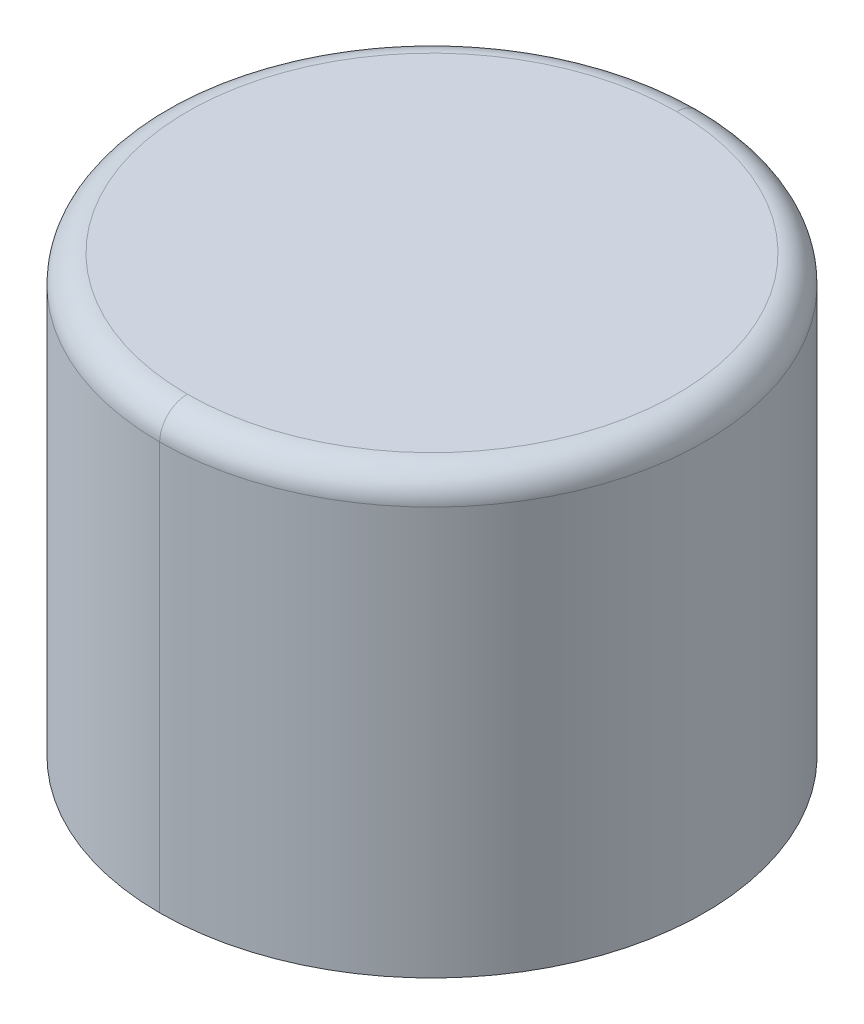
ISO-10303-21;
HEADER;
FILE_DESCRIPTION(('STEP AP214'),'2;1');
FILE_NAME('part.step','',(''),(''),'','','');
FILE_SCHEMA(('AUTOMOTIVE_DESIGN { 1 0 10303 214 1 1 1 1 }'));
ENDSEC;
DATA;
#1=APPLICATION_CONTEXT('core data for automotive mechanical design processes');
#2=APPLICATION_PROTOCOL_DEFINITION('international standard','automotive_design',2000,#1);
#3=PRODUCT_CONTEXT('',#1,'mechanical');
#4=PRODUCT('Part','Part','',(#3));
#5=PRODUCT_RELATED_PRODUCT_CATEGORY('part','',(#4));
#6=PRODUCT_DEFINITION_FORMATION('','',#4);
#7=PRODUCT_DEFINITION_CONTEXT('part definition',#1,'design');
#8=PRODUCT_DEFINITION('design','',#6,#7);
#9=PRODUCT_DEFINITION_SHAPE('','',#8);
#10=(LENGTH_UNIT() NAMED_UNIT(*) SI_UNIT(.MILLI.,.METRE.));
#11=(NAMED_UNIT(*) PLANE_ANGLE_UNIT() SI_UNIT($,.RADIAN.));
#12=(NAMED_UNIT(*) SI_UNIT($,.STERADIAN.) SOLID_ANGLE_UNIT());
#13=UNCERTAINTY_MEASURE_WITH_UNIT(LENGTH_MEASURE(1.E-05),#10,'distance_accuracy_value','');
#14=(GEOMETRIC_REPRESENTATION_CONTEXT(3) GLOBAL_UNCERTAINTY_ASSIGNED_CONTEXT((#13)) GLOBAL_UNIT_ASSIGNED_CONTEXT((#10,
#11,#12)) REPRESENTATION_CONTEXT('',''));
#15=CARTESIAN_POINT('',(0.,0.,0.));
#16=DIRECTION('',(0.,0.,1.));
#17=DIRECTION('',(1.,0.,0.));
#18=AXIS2_PLACEMENT_3D('',#15,#16,#17);
#19=CARTESIAN_POINT('',(0.,0.,0.));
#20=DIRECTION('',(0.,1.,0.));
#21=DIRECTION('',(-1.,0.,0.));
#22=AXIS2_PLACEMENT_3D('',#19,#20,#21);
#23=CYLINDRICAL_SURFACE('',#22,5.0038);
#24=CARTESIAN_POINT('',(0.,0.,0.));
#25=DIRECTION('',(0.,-1.,0.));
#26=DIRECTION('',(0.,0.,-1.));
#27=AXIS2_PLACEMENT_3D('',#24,#25,#26);
#28=CIRCLE('',#27,5.0038);
#29=CARTESIAN_POINT('',(0.,0.,-5.0038));
#30=VERTEX_POINT('',#29);
#31=CARTESIAN_POINT('',(0.,0.,5.0038));
#32=VERTEX_POINT('',#31);
#33=EDGE_CURVE('E11',#30,#32,#28,.T.);
#34=ORIENTED_EDGE('',*,*,#33,.F.);
#35=CARTESIAN_POINT('',(0.,0.,-5.0038));
#36=DIRECTION('',(0.,1.,0.));
#37=VECTOR('',#36,1.);
#38=LINE('',#35,#37);
#39=CARTESIAN_POINT('',(0.,7.49300000000013,-5.0038));
#40=VERTEX_POINT('',#39);
#41=EDGE_CURVE('E27',#30,#40,#38,.T.);
#42=ORIENTED_EDGE('',*,*,#41,.T.);
#43=CARTESIAN_POINT('',(0.,7.49300000000013,0.));
#44=DIRECTION('',(0.,-1.,0.));
#45=DIRECTION('',(0.,0.,-1.));
#46=AXIS2_PLACEMENT_3D('',#43,#44,#45);
#47=CIRCLE('',#46,5.0038);
#48=CARTESIAN_POINT('',(0.,7.49300000000013,5.0038));
#49=VERTEX_POINT('',#48);
#50=EDGE_CURVE('E137',#40,#49,#47,.T.);
#51=ORIENTED_EDGE('',*,*,#50,.T.);
#52=CARTESIAN_POINT('',(0.,0.,5.0038));
#53=DIRECTION('',(0.,1.,0.));
#54=VECTOR('',#53,1.);
#55=LINE('',#52,#54);
#56=EDGE_CURVE('E125',#32,#49,#55,.T.);
#57=ORIENTED_EDGE('',*,*,#56,.F.);
#58=EDGE_LOOP('',(#34,#42,#51,#57));
#59=FACE_BOUND('',#58,.T.);
#60=ADVANCED_FACE('F17',(#59),#23,.T.);
#61=CARTESIAN_POINT('',(0.,0.,0.));
#62=DIRECTION('',(0.,1.,0.));
#63=DIRECTION('',(1.,0.,0.));
#64=AXIS2_PLACEMENT_3D('',#61,#62,#63);
#65=CYLINDRICAL_SURFACE('',#64,5.0038);
#66=CARTESIAN_POINT('',(0.,7.49300000000013,0.));
#67=DIRECTION('',(0.,-1.,0.));
#68=DIRECTION('',(0.,0.,-1.));
#69=AXIS2_PLACEMENT_3D('',#66,#67,#68);
#70=CIRCLE('',#69,5.0038);
#71=EDGE_CURVE('E65',#49,#40,#70,.T.);
#72=ORIENTED_EDGE('',*,*,#71,.T.);
#73=ORIENTED_EDGE('',*,*,#41,.F.);
#74=CARTESIAN_POINT('',(0.,0.,0.));
#75=DIRECTION('',(0.,-1.,0.));
#76=DIRECTION('',(0.,0.,-1.));
#77=AXIS2_PLACEMENT_3D('',#74,#75,#76);
#78=CIRCLE('',#77,5.0038);
#79=EDGE_CURVE('E82',#32,#30,#78,.T.);
#80=ORIENTED_EDGE('',*,*,#79,.F.);
#81=ORIENTED_EDGE('',*,*,#56,.T.);
#82=EDGE_LOOP('',(#72,#73,#80,#81));
#83=FACE_BOUND('',#82,.T.);
#84=ADVANCED_FACE('F98',(#83),#65,.T.);
#85=CARTESIAN_POINT('',(5.0038,0.,0.));
#86=DIRECTION('',(0.,1.,0.));
#87=DIRECTION('',(0.,0.,1.));
#88=AXIS2_PLACEMENT_3D('',#85,#86,#87);
#89=PLANE('',#88);
#90=ORIENTED_EDGE('',*,*,#33,.T.);
#91=ORIENTED_EDGE('',*,*,#79,.T.);
#92=EDGE_LOOP('',(#90,#91));
#93=FACE_BOUND('',#92,.T.);
#94=ADVANCED_FACE('F107',(#93),#89,.F.);
#95=CARTESIAN_POINT('',(0.,7.49300000000013,0.));
#96=DIRECTION('',(0.,-1.,0.));
#97=DIRECTION('',(1.,0.,0.));
#98=AXIS2_PLACEMENT_3D('',#95,#96,#97);
#99=TOROIDAL_SURFACE('',#98,4.49580000000013,0.507999999999883);
#100=CARTESIAN_POINT('',(0.,8.001,0.));
#101=DIRECTION('',(0.,-1.,0.));
#102=DIRECTION('',(0.,0.,-1.));
#103=AXIS2_PLACEMENT_3D('',#100,#101,#102);
#104=CIRCLE('',#103,4.4958);
#105=CARTESIAN_POINT('',(0.,8.00100000000001,4.4958));
#106=VERTEX_POINT('',#105);
#107=CARTESIAN_POINT('',(0.,8.001,-4.4958));
#108=VERTEX_POINT('',#107);
#109=EDGE_CURVE('E63',#106,#108,#104,.T.);
#110=ORIENTED_EDGE('',*,*,#109,.T.);
#111=CARTESIAN_POINT('',(0.,8.00100000000001,-4.4958));
#112=CARTESIAN_POINT('',(0.,8.00100017632111,-4.50411213895653));
#113=CARTESIAN_POINT('',(0.,8.00079599589959,-4.51242426290986));
#114=CARTESIAN_POINT('',(0.,7.9999801876049,-4.52902849420678));
#115=CARTESIAN_POINT('',(0.,7.99936855973172,-4.53732060155037));
#116=CARTESIAN_POINT('',(0.,7.99773912256728,-4.55386481302445));
#117=CARTESIAN_POINT('',(0.,7.99672131327602,-4.56211691715494));
#118=CARTESIAN_POINT('',(0.,7.99428202084826,-4.5785612448917));
#119=CARTESIAN_POINT('',(0.,7.99286053771176,-4.58675346849796));
#120=CARTESIAN_POINT('',(0.,7.98961730717799,-4.60305829867041));
#121=CARTESIAN_POINT('',(0.,7.98779555978072,-4.61117090523659));
#122=CARTESIAN_POINT('',(0.,7.98375619346501,-4.62729695754511));
#123=CARTESIAN_POINT('',(0.,7.98153857454657,-4.63531040328745));
#124=CARTESIAN_POINT('',(0.,7.97671280655745,-4.65121882880307));
#125=CARTESIAN_POINT('',(0.,7.97410465748678,-4.65911380857635));
#126=CARTESIAN_POINT('',(0.,7.96850411273927,-4.67476628247013));
#127=CARTESIAN_POINT('',(0.,7.96551171706244,-4.68252377659063));
#128=CARTESIAN_POINT('',(0.,7.95914988796914,-4.69788259069228));
#129=CARTESIAN_POINT('',(0.,7.95578045455267,-4.70548391067342));
#130=CARTESIAN_POINT('',(0.,7.94867266726088,-4.72051206425173));
#131=CARTESIAN_POINT('',(0.,7.94493431338556,-4.72793889784889));
#132=CARTESIAN_POINT('',(0.,7.9370976911925,-4.74260018676631));
#133=CARTESIAN_POINT('',(0.,7.93299942287476,-4.74983464208657));
#134=CARTESIAN_POINT('',(0.,7.92445284488566,-4.76409374601373));
#135=CARTESIAN_POINT('',(0.,7.92000453521431,-4.77111839462063));
#136=CARTESIAN_POINT('',(0.,7.91076859088523,-4.78494096212727));
#137=CARTESIAN_POINT('',(0.,7.9059809562275,-4.79173888102701));
#138=CARTESIAN_POINT('',(0.,7.896077895757,-4.80509161233729));
#139=CARTESIAN_POINT('',(0.,7.89096246994423,-4.81164642474782));
#140=CARTESIAN_POINT('',(0.,7.88041615067248,-4.82449715196244));
#141=CARTESIAN_POINT('',(0.,7.87498525721349,-4.83079306676652));
#142=CARTESIAN_POINT('',(0.,7.86382108614733,-4.84311083135804));
#143=CARTESIAN_POINT('',(0.,7.85808780854016,-4.84913268114546));
#144=CARTESIAN_POINT('',(0.,7.84633268114556,-4.86088780854006));
#145=CARTESIAN_POINT('',(0.,7.84031083135813,-4.86662108614723));
#146=CARTESIAN_POINT('',(0.,7.82799306676663,-4.8777852572134));
#147=CARTESIAN_POINT('',(0.,7.82169715196254,-4.88321615067239));
#148=CARTESIAN_POINT('',(0.,7.80884642474792,-4.89376246994415));
#149=CARTESIAN_POINT('',(0.,7.80229161233739,-4.89887789575692));
#150=CARTESIAN_POINT('',(0.,7.78893888102712,-4.90878095622742));
#151=CARTESIAN_POINT('',(0.,7.78214096212738,-4.91356859088515));
#152=CARTESIAN_POINT('',(0.,7.76831839462074,-4.92280453521424));
#153=CARTESIAN_POINT('',(0.,7.76129374601384,-4.92725284488559));
#154=CARTESIAN_POINT('',(0.,7.74703464208668,-4.93579942287469));
#155=CARTESIAN_POINT('',(0.,7.73980018676643,-4.93989769119244));
#156=CARTESIAN_POINT('',(0.,7.72513889784901,-4.9477343133855));
#157=CARTESIAN_POINT('',(0.,7.71771206425185,-4.95147266726082));
#158=CARTESIAN_POINT('',(0.,7.70268391067354,-4.95858045455261));
#159=CARTESIAN_POINT('',(0.,7.6950825906924,-4.96194988796908));
#160=CARTESIAN_POINT('',(0.,7.67972377659076,-4.96831171706239));
#161=CARTESIAN_POINT('',(0.,7.67196628247026,-4.97130411273923));
#162=CARTESIAN_POINT('',(0.,7.65631380857647,-4.97690465748673));
#163=CARTESIAN_POINT('',(0.,7.64841882880319,-4.97951280655741));
#164=CARTESIAN_POINT('',(0.,7.63251040328758,-4.98433857454653));
#165=CARTESIAN_POINT('',(0.,7.62449695754524,-4.98655619346498));
#166=CARTESIAN_POINT('',(0.,7.60837090523672,-4.99059555978069));
#167=CARTESIAN_POINT('',(0.,7.60025829867054,-4.99241730717796));
#168=CARTESIAN_POINT('',(0.,7.58395346849809,-4.99566053771173));
#169=CARTESIAN_POINT('',(0.,7.57576124489183,-4.99708202084823));
#170=CARTESIAN_POINT('',(0.,7.55931691715507,-4.999521313276));
#171=CARTESIAN_POINT('',(0.,7.55106481302458,-5.00053912256726));
#172=CARTESIAN_POINT('',(0.,7.53452060155051,-5.00216855973171));
#173=CARTESIAN_POINT('',(0.,7.52622849420692,-5.00278018760489));
#174=CARTESIAN_POINT('',(0.,7.50962426291,-5.00359599589959));
#175=CARTESIAN_POINT('',(0.,7.50131213895666,-5.00380017632111));
#176=CARTESIAN_POINT('',(0.,7.49300000000013,-5.00380000000001));
#177=B_SPLINE_CURVE_WITH_KNOTS('',3,(#111,#112,#113,#114,#115,#116,#117,#118,#119,#120,#121,
#122,#123,#124,#125,#126,#127,#128,#129,#130,#131,#132,#133,#134,#135,#136,#137,#138,#139,#140,
#141,#142,#143,#144,#145,#146,#147,#148,#149,#150,#151,#152,#153,#154,#155,#156,#157,#158,#159,
#160,#161,#162,#163,#164,#165,#166,#167,#168,#169,#170,#171,#172,#173,#174,#175,#176),
.UNSPECIFIED.,.F.,.F.,(4,2,2,2,2,2,2,2,2,2,2,2,2,2,2,2,2,2,2,2,2,2,2,2,2,2,2,2,2,2,2,2,4),(0.,
0.0249338881792772,0.0498677763585547,0.0748016645378318,0.0997355527171088,0.124669440896385,
0.149603329075663,0.17453721725494,0.199471105434217,0.224404993613494,0.249338881792771,
0.274272769972048,0.299206658151325,0.324140546330603,0.34907443450988,0.374008322689157,
0.398942210868434,0.42387609904771,0.448809987226987,0.473743875406265,0.498677763585542,
0.523611651764819,0.548545539944096,0.573479428123373,0.59841331630265,0.623347204481927,
0.648281092661205,0.673214980840482,0.698148869019759,0.723082757199036,0.748016645378313,
0.77295053355759,0.797884421736867),.UNSPECIFIED.);
#178=EDGE_CURVE('E70',#108,#40,#177,.T.);
#179=ORIENTED_EDGE('',*,*,#178,.T.);
#180=ORIENTED_EDGE('',*,*,#71,.F.);
#181=CARTESIAN_POINT('',(0.,8.00100000000001,4.4958));
#182=CARTESIAN_POINT('',(0.,8.00100017632111,4.50411213895653));
#183=CARTESIAN_POINT('',(0.,8.00079599589959,4.51242426290986));
#184=CARTESIAN_POINT('',(0.,7.9999801876049,4.52902849420678));
#185=CARTESIAN_POINT('',(0.,7.99936855973172,4.53732060155037));
#186=CARTESIAN_POINT('',(0.,7.99773912256728,4.55386481302445));
#187=CARTESIAN_POINT('',(0.,7.99672131327602,4.56211691715494));
#188=CARTESIAN_POINT('',(0.,7.99428202084826,4.5785612448917));
#189=CARTESIAN_POINT('',(0.,7.99286053771176,4.58675346849796));
#190=CARTESIAN_POINT('',(0.,7.98961730717799,4.60305829867041));
#191=CARTESIAN_POINT('',(0.,7.98779555978072,4.61117090523659));
#192=CARTESIAN_POINT('',(0.,7.98375619346501,4.62729695754511));
#193=CARTESIAN_POINT('',(0.,7.98153857454657,4.63531040328745));
#194=CARTESIAN_POINT('',(0.,7.97671280655745,4.65121882880307));
#195=CARTESIAN_POINT('',(0.,7.97410465748678,4.65911380857635));
#196=CARTESIAN_POINT('',(0.,7.96850411273927,4.67476628247013));
#197=CARTESIAN_POINT('',(0.,7.96551171706244,4.68252377659063));
#198=CARTESIAN_POINT('',(0.,7.95914988796914,4.69788259069228));
#199=CARTESIAN_POINT('',(0.,7.95578045455267,4.70548391067342));
#200=CARTESIAN_POINT('',(0.,7.94867266726088,4.72051206425173));
#201=CARTESIAN_POINT('',(0.,7.94493431338556,4.72793889784889));
#202=CARTESIAN_POINT('',(0.,7.9370976911925,4.74260018676631));
#203=CARTESIAN_POINT('',(0.,7.93299942287476,4.74983464208657));
#204=CARTESIAN_POINT('',(0.,7.92445284488566,4.76409374601373));
#205=CARTESIAN_POINT('',(0.,7.92000453521431,4.77111839462063));
#206=CARTESIAN_POINT('',(0.,7.91076859088523,4.78494096212727));
#207=CARTESIAN_POINT('',(0.,7.9059809562275,4.79173888102701));
#208=CARTESIAN_POINT('',(0.,7.896077895757,4.80509161233729));
#209=CARTESIAN_POINT('',(0.,7.89096246994423,4.81164642474782));
#210=CARTESIAN_POINT('',(0.,7.88041615067248,4.82449715196244));
#211=CARTESIAN_POINT('',(0.,7.87498525721349,4.83079306676652));
#212=CARTESIAN_POINT('',(0.,7.86382108614733,4.84311083135804));
#213=CARTESIAN_POINT('',(0.,7.85808780854016,4.84913268114546));
#214=CARTESIAN_POINT('',(0.,7.84633268114556,4.86088780854006));
#215=CARTESIAN_POINT('',(0.,7.84031083135813,4.86662108614723));
#216=CARTESIAN_POINT('',(0.,7.82799306676663,4.8777852572134));
#217=CARTESIAN_POINT('',(0.,7.82169715196254,4.88321615067239));
#218=CARTESIAN_POINT('',(0.,7.80884642474792,4.89376246994415));
#219=CARTESIAN_POINT('',(0.,7.80229161233739,4.89887789575692));
#220=CARTESIAN_POINT('',(0.,7.78893888102712,4.90878095622742));
#221=CARTESIAN_POINT('',(0.,7.78214096212738,4.91356859088515));
#222=CARTESIAN_POINT('',(0.,7.76831839462074,4.92280453521424));
#223=CARTESIAN_POINT('',(0.,7.76129374601384,4.92725284488559));
#224=CARTESIAN_POINT('',(0.,7.74703464208668,4.93579942287469));
#225=CARTESIAN_POINT('',(0.,7.73980018676643,4.93989769119244));
#226=CARTESIAN_POINT('',(0.,7.72513889784901,4.9477343133855));
#227=CARTESIAN_POINT('',(0.,7.71771206425185,4.95147266726082));
#228=CARTESIAN_POINT('',(0.,7.70268391067354,4.95858045455261));
#229=CARTESIAN_POINT('',(0.,7.6950825906924,4.96194988796908));
#230=CARTESIAN_POINT('',(0.,7.67972377659076,4.96831171706239));
#231=CARTESIAN_POINT('',(0.,7.67196628247025,4.97130411273923));
#232=CARTESIAN_POINT('',(0.,7.65631380857647,4.97690465748673));
#233=CARTESIAN_POINT('',(0.,7.64841882880319,4.97951280655741));
#234=CARTESIAN_POINT('',(0.,7.63251040328758,4.98433857454653));
#235=CARTESIAN_POINT('',(0.,7.62449695754524,4.98655619346498));
#236=CARTESIAN_POINT('',(0.,7.60837090523672,4.99059555978069));
#237=CARTESIAN_POINT('',(0.,7.60025829867054,4.99241730717796));
#238=CARTESIAN_POINT('',(0.,7.58395346849809,4.99566053771173));
#239=CARTESIAN_POINT('',(0.,7.57576124489183,4.99708202084823));
#240=CARTESIAN_POINT('',(0.,7.55931691715507,4.999521313276));
#241=CARTESIAN_POINT('',(0.,7.55106481302458,5.00053912256726));
#242=CARTESIAN_POINT('',(0.,7.5345206015505,5.00216855973171));
#243=CARTESIAN_POINT('',(0.,7.52622849420692,5.00278018760489));
#244=CARTESIAN_POINT('',(0.,7.50962426291,5.00359599589959));
#245=CARTESIAN_POINT('',(0.,7.50131213895666,5.00380017632111));
#246=CARTESIAN_POINT('',(0.,7.49300000000013,5.00380000000001));
#247=B_SPLINE_CURVE_WITH_KNOTS('',3,(#181,#182,#183,#184,#185,#186,#187,#188,#189,#190,#191,
#192,#193,#194,#195,#196,#197,#198,#199,#200,#201,#202,#203,#204,#205,#206,#207,#208,#209,#210,
#211,#212,#213,#214,#215,#216,#217,#218,#219,#220,#221,#222,#223,#224,#225,#226,#227,#228,#229,
#230,#231,#232,#233,#234,#235,#236,#237,#238,#239,#240,#241,#242,#243,#244,#245,#246),
.UNSPECIFIED.,.F.,.F.,(4,2,2,2,2,2,2,2,2,2,2,2,2,2,2,2,2,2,2,2,2,2,2,2,2,2,2,2,2,2,2,2,4),(0.,
0.0249338881792772,0.0498677763585539,0.0748016645378309,0.099735552717108,0.124669440896385,
0.149603329075662,0.174537217254939,0.199471105434217,0.224404993613494,0.249338881792771,
0.274272769972048,0.299206658151324,0.324140546330602,0.349074434509879,0.374008322689156,
0.398942210868433,0.42387609904771,0.448809987226988,0.473743875406264,0.498677763585541,
0.523611651764819,0.548545539944096,0.573479428123373,0.59841331630265,0.623347204481927,
0.648281092661205,0.673214980840481,0.698148869019759,0.723082757199035,0.748016645378313,
0.77295053355759,0.797884421736866),.UNSPECIFIED.);
#248=EDGE_CURVE('E57',#106,#49,#247,.T.);
#249=ORIENTED_EDGE('',*,*,#248,.F.);
#250=EDGE_LOOP('',(#110,#179,#180,#249));
#251=FACE_BOUND('',#250,.T.);
#252=ADVANCED_FACE('F60',(#251),#99,.T.);
#253=CARTESIAN_POINT('',(0.,7.49300000000013,0.));
#254=DIRECTION('',(0.,-1.,0.));
#255=DIRECTION('',(-1.,0.,0.));
#256=AXIS2_PLACEMENT_3D('',#253,#254,#255);
#257=TOROIDAL_SURFACE('',#256,4.49580000000013,0.507999999999883);
#258=ORIENTED_EDGE('',*,*,#50,.F.);
#259=ORIENTED_EDGE('',*,*,#178,.F.);
#260=CARTESIAN_POINT('',(0.,8.001,0.));
#261=DIRECTION('',(0.,-1.,0.));
#262=DIRECTION('',(0.,0.,-1.));
#263=AXIS2_PLACEMENT_3D('',#260,#261,#262);
#264=CIRCLE('',#263,4.4958);
#265=EDGE_CURVE('E71',#108,#106,#264,.T.);
#266=ORIENTED_EDGE('',*,*,#265,.T.);
#267=ORIENTED_EDGE('',*,*,#248,.T.);
#268=EDGE_LOOP('',(#258,#259,#266,#267));
#269=FACE_BOUND('',#268,.T.);
#270=ADVANCED_FACE('F75',(#269),#257,.T.);
#271=CARTESIAN_POINT('',(0.,8.001,0.));
#272=DIRECTION('',(0.,-1.,0.));
#273=DIRECTION('',(0.,0.,-1.));
#274=AXIS2_PLACEMENT_3D('',#271,#272,#273);
#275=PLANE('',#274);
#276=ORIENTED_EDGE('',*,*,#265,.F.);
#277=ORIENTED_EDGE('',*,*,#109,.F.);
#278=EDGE_LOOP('',(#276,#277));
#279=FACE_BOUND('',#278,.T.);
#280=ADVANCED_FACE('F80',(#279),#275,.F.);
#281=CLOSED_SHELL('',(#60,#84,#94,#252,#270,#280));
#282=MANIFOLD_SOLID_BREP('B1',#281);
#283=ADVANCED_BREP_SHAPE_REPRESENTATION('',(#18,#282),#14);
#284=SHAPE_DEFINITION_REPRESENTATION(#9,#283);
ENDSEC;
END-ISO-10303-21;
